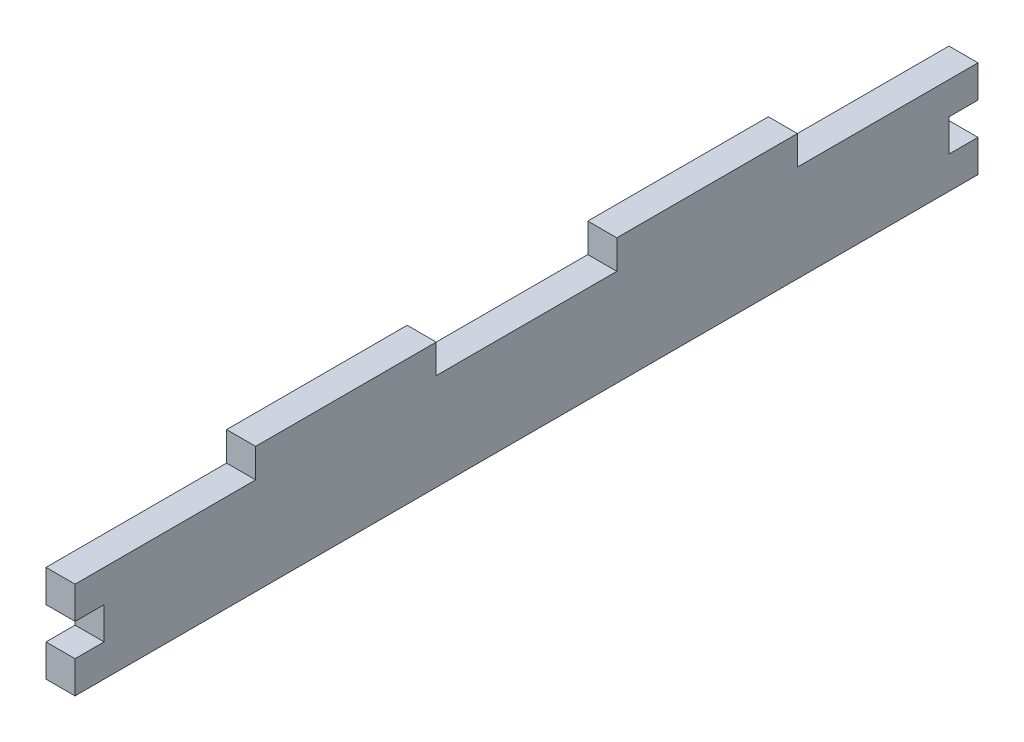
ISO-10303-21;
HEADER;
FILE_DESCRIPTION(('STEP AP214'),'2;1');
FILE_NAME('part.step','',(''),(''),'','','');
FILE_SCHEMA(('AUTOMOTIVE_DESIGN { 1 0 10303 214 1 1 1 1 }'));
ENDSEC;
DATA;
#1=APPLICATION_CONTEXT('core data for automotive mechanical design processes');
#2=APPLICATION_PROTOCOL_DEFINITION('international standard','automotive_design',2000,#1);
#3=PRODUCT_CONTEXT('',#1,'mechanical');
#4=PRODUCT('Part','Part','',(#3));
#5=PRODUCT_RELATED_PRODUCT_CATEGORY('part','',(#4));
#6=PRODUCT_DEFINITION_FORMATION('','',#4);
#7=PRODUCT_DEFINITION_CONTEXT('part definition',#1,'design');
#8=PRODUCT_DEFINITION('design','',#6,#7);
#9=PRODUCT_DEFINITION_SHAPE('','',#8);
#10=(LENGTH_UNIT() NAMED_UNIT(*) SI_UNIT(.MILLI.,.METRE.));
#11=(NAMED_UNIT(*) PLANE_ANGLE_UNIT() SI_UNIT($,.RADIAN.));
#12=(NAMED_UNIT(*) SI_UNIT($,.STERADIAN.) SOLID_ANGLE_UNIT());
#13=UNCERTAINTY_MEASURE_WITH_UNIT(LENGTH_MEASURE(1.E-05),#10,'distance_accuracy_value','');
#14=(GEOMETRIC_REPRESENTATION_CONTEXT(3) GLOBAL_UNCERTAINTY_ASSIGNED_CONTEXT((#13)) GLOBAL_UNIT_ASSIGNED_CONTEXT((#10,
#11,#12)) REPRESENTATION_CONTEXT('',''));
#15=CARTESIAN_POINT('',(0.,0.,0.));
#16=DIRECTION('',(0.,0.,1.));
#17=DIRECTION('',(1.,0.,0.));
#18=AXIS2_PLACEMENT_3D('',#15,#16,#17);
#19=CARTESIAN_POINT('',(2.15683952179781E-13,-14.,-93.2499999999994));
#20=DIRECTION('',(0.,0.,1.));
#21=DIRECTION('',(1.,0.,0.));
#22=AXIS2_PLACEMENT_3D('',#19,#20,#21);
#23=PLANE('',#22);
#24=DIRECTION('',(0.,1.,0.));
#25=VECTOR('',#24,1.);
#26=CARTESIAN_POINT('',(-231.5,-14.,-93.2499999999999));
#27=LINE('',#26,#25);
#28=CARTESIAN_POINT('',(-231.5,-0.666666666666667,-93.25));
#29=VERTEX_POINT('',#28);
#30=CARTESIAN_POINT('',(-231.5,6.,-93.2499999999999));
#31=VERTEX_POINT('',#30);
#32=EDGE_CURVE('E298',#29,#31,#27,.T.);
#33=ORIENTED_EDGE('',*,*,#32,.F.);
#34=DIRECTION('',(1.,0.,0.));
#35=VECTOR('',#34,1.);
#36=CARTESIAN_POINT('',(0.,-0.666666666666633,-93.25));
#37=LINE('',#36,#35);
#38=CARTESIAN_POINT('',(-237.5,-0.666666666666667,-93.25));
#39=VERTEX_POINT('',#38);
#40=EDGE_CURVE('E183',#39,#29,#37,.T.);
#41=ORIENTED_EDGE('',*,*,#40,.F.);
#42=DIRECTION('',(0.,1.,0.));
#43=VECTOR('',#42,1.);
#44=CARTESIAN_POINT('',(-237.5,-14.,-93.2499999999999));
#45=LINE('',#44,#43);
#46=CARTESIAN_POINT('',(-237.5,6.,-93.2499999999999));
#47=VERTEX_POINT('',#46);
#48=EDGE_CURVE('E318',#39,#47,#45,.T.);
#49=ORIENTED_EDGE('',*,*,#48,.T.);
#50=DIRECTION('',(1.,0.,0.));
#51=VECTOR('',#50,1.);
#52=CARTESIAN_POINT('',(2.15683952179781E-13,6.,-93.2499999999994));
#53=LINE('',#52,#51);
#54=EDGE_CURVE('E302',#47,#31,#53,.T.);
#55=ORIENTED_EDGE('',*,*,#54,.T.);
#56=EDGE_LOOP('',(#33,#41,#49,#55));
#57=FACE_BOUND('',#56,.T.);
#58=ADVANCED_FACE('F36',(#57),#23,.F.);
#59=CARTESIAN_POINT('',(-231.5,-14.,1.72263156970995E-13));
#60=DIRECTION('',(-1.,0.,0.));
#61=DIRECTION('',(0.,0.,1.));
#62=AXIS2_PLACEMENT_3D('',#59,#60,#61);
#63=PLANE('',#62);
#64=DIRECTION('',(0.,1.,0.));
#65=VECTOR('',#64,1.);
#66=CARTESIAN_POINT('',(-231.5,0.,-87.25));
#67=LINE('',#66,#65);
#68=CARTESIAN_POINT('',(-231.5,-7.33333333333333,-87.25));
#69=VERTEX_POINT('',#68);
#70=CARTESIAN_POINT('',(-231.5,-0.666666666666667,-87.25));
#71=VERTEX_POINT('',#70);
#72=EDGE_CURVE('E192',#69,#71,#67,.T.);
#73=ORIENTED_EDGE('',*,*,#72,.T.);
#74=DIRECTION('',(0.,0.,-1.));
#75=VECTOR('',#74,1.);
#76=CARTESIAN_POINT('',(-231.5,-0.666666666666667,-87.25));
#77=LINE('',#76,#75);
#78=EDGE_CURVE('E177',#71,#29,#77,.T.);
#79=ORIENTED_EDGE('',*,*,#78,.T.);
#80=ORIENTED_EDGE('',*,*,#32,.T.);
#81=DIRECTION('',(0.,0.,1.));
#82=VECTOR('',#81,1.);
#83=CARTESIAN_POINT('',(-231.5,6.,1.72263156970995E-13));
#84=LINE('',#83,#82);
#85=CARTESIAN_POINT('',(-231.5,6.,-55.9499999999999));
#86=VERTEX_POINT('',#85);
#87=EDGE_CURVE('E299',#31,#86,#84,.T.);
#88=ORIENTED_EDGE('',*,*,#87,.T.);
#89=DIRECTION('',(0.,-1.,0.));
#90=VECTOR('',#89,1.);
#91=CARTESIAN_POINT('',(-231.5,12.,-55.9499999999999));
#92=LINE('',#91,#90);
#93=CARTESIAN_POINT('',(-231.5,12.,-55.9499999999999));
#94=VERTEX_POINT('',#93);
#95=EDGE_CURVE('E274',#94,#86,#92,.T.);
#96=ORIENTED_EDGE('',*,*,#95,.F.);
#97=DIRECTION('',(0.,0.,1.));
#98=VECTOR('',#97,1.);
#99=CARTESIAN_POINT('',(-231.5,12.,0.));
#100=LINE('',#99,#98);
#101=CARTESIAN_POINT('',(-231.5,12.,-18.6499999999999));
#102=VERTEX_POINT('',#101);
#103=EDGE_CURVE('E271',#94,#102,#100,.T.);
#104=ORIENTED_EDGE('',*,*,#103,.T.);
#105=DIRECTION('',(0.,-1.,0.));
#106=VECTOR('',#105,1.);
#107=CARTESIAN_POINT('',(-231.5,12.,-18.6499999999999));
#108=LINE('',#107,#106);
#109=CARTESIAN_POINT('',(-231.5,6.,-18.6499999999999));
#110=VERTEX_POINT('',#109);
#111=EDGE_CURVE('E280',#102,#110,#108,.T.);
#112=ORIENTED_EDGE('',*,*,#111,.T.);
#113=CARTESIAN_POINT('',(-231.5,6.,18.65));
#114=VERTEX_POINT('',#113);
#115=EDGE_CURVE('E303',#110,#114,#84,.T.);
#116=ORIENTED_EDGE('',*,*,#115,.T.);
#117=DIRECTION('',(0.,-1.,0.));
#118=VECTOR('',#117,1.);
#119=CARTESIAN_POINT('',(-231.5,12.,18.65));
#120=LINE('',#119,#118);
#121=CARTESIAN_POINT('',(-231.5,12.,18.65));
#122=VERTEX_POINT('',#121);
#123=EDGE_CURVE('E246',#122,#114,#120,.T.);
#124=ORIENTED_EDGE('',*,*,#123,.F.);
#125=DIRECTION('',(0.,0.,1.));
#126=VECTOR('',#125,1.);
#127=CARTESIAN_POINT('',(-231.5,12.,0.));
#128=LINE('',#127,#126);
#129=CARTESIAN_POINT('',(-231.5,12.,55.95));
#130=VERTEX_POINT('',#129);
#131=EDGE_CURVE('E243',#122,#130,#128,.T.);
#132=ORIENTED_EDGE('',*,*,#131,.T.);
#133=DIRECTION('',(0.,-1.,0.));
#134=VECTOR('',#133,1.);
#135=CARTESIAN_POINT('',(-231.5,12.,55.95));
#136=LINE('',#135,#134);
#137=CARTESIAN_POINT('',(-231.5,6.,55.95));
#138=VERTEX_POINT('',#137);
#139=EDGE_CURVE('E252',#130,#138,#136,.T.);
#140=ORIENTED_EDGE('',*,*,#139,.T.);
#141=CARTESIAN_POINT('',(-231.5,6.,93.25));
#142=VERTEX_POINT('',#141);
#143=EDGE_CURVE('E286',#138,#142,#84,.T.);
#144=ORIENTED_EDGE('',*,*,#143,.T.);
#145=DIRECTION('',(0.,1.,0.));
#146=VECTOR('',#145,1.);
#147=CARTESIAN_POINT('',(-231.5,-14.,93.25));
#148=LINE('',#147,#146);
#149=CARTESIAN_POINT('',(-231.5,-0.666666666666667,93.25));
#150=VERTEX_POINT('',#149);
#151=EDGE_CURVE('E45',#150,#142,#148,.T.);
#152=ORIENTED_EDGE('',*,*,#151,.F.);
#153=DIRECTION('',(0.,0.,1.));
#154=VECTOR('',#153,1.);
#155=CARTESIAN_POINT('',(-231.5,-0.666666666666667,87.25));
#156=LINE('',#155,#154);
#157=CARTESIAN_POINT('',(-231.5,-0.666666666666667,87.25));
#158=VERTEX_POINT('',#157);
#159=EDGE_CURVE('E224',#158,#150,#156,.T.);
#160=ORIENTED_EDGE('',*,*,#159,.F.);
#161=DIRECTION('',(0.,1.,0.));
#162=VECTOR('',#161,1.);
#163=CARTESIAN_POINT('',(-231.5,0.,87.25));
#164=LINE('',#163,#162);
#165=CARTESIAN_POINT('',(-231.5,-7.33333333333333,87.25));
#166=VERTEX_POINT('',#165);
#167=EDGE_CURVE('E217',#166,#158,#164,.T.);
#168=ORIENTED_EDGE('',*,*,#167,.F.);
#169=DIRECTION('',(0.,0.,1.));
#170=VECTOR('',#169,1.);
#171=CARTESIAN_POINT('',(-231.5,-7.33333333333333,87.25));
#172=LINE('',#171,#170);
#173=CARTESIAN_POINT('',(-231.5,-7.33333333333333,93.25));
#174=VERTEX_POINT('',#173);
#175=EDGE_CURVE('E227',#166,#174,#172,.T.);
#176=ORIENTED_EDGE('',*,*,#175,.T.);
#177=CARTESIAN_POINT('',(-231.5,-14.,93.25));
#178=VERTEX_POINT('',#177);
#179=EDGE_CURVE('E11',#178,#174,#148,.T.);
#180=ORIENTED_EDGE('',*,*,#179,.F.);
#181=DIRECTION('',(0.,0.,1.));
#182=VECTOR('',#181,1.);
#183=CARTESIAN_POINT('',(-231.5,-14.,1.72263156970995E-13));
#184=LINE('',#183,#182);
#185=CARTESIAN_POINT('',(-231.5,-14.,-93.2499999999999));
#186=VERTEX_POINT('',#185);
#187=EDGE_CURVE('E287',#186,#178,#184,.T.);
#188=ORIENTED_EDGE('',*,*,#187,.F.);
#189=CARTESIAN_POINT('',(-231.5,-7.33333333333333,-93.2499999999999));
#190=VERTEX_POINT('',#189);
#191=EDGE_CURVE('E40',#186,#190,#27,.T.);
#192=ORIENTED_EDGE('',*,*,#191,.T.);
#193=DIRECTION('',(0.,0.,-1.));
#194=VECTOR('',#193,1.);
#195=CARTESIAN_POINT('',(-231.5,-7.33333333333333,-87.25));
#196=LINE('',#195,#194);
#197=EDGE_CURVE('E53',#69,#190,#196,.T.);
#198=ORIENTED_EDGE('',*,*,#197,.F.);
#199=EDGE_LOOP('',(#73,#79,#80,#88,#96,#104,#112,#116,#124,#132,#140,#144,#152,#160,#168,#176,
#180,#188,#192,#198));
#200=FACE_BOUND('',#199,.T.);
#201=ADVANCED_FACE('F38',(#200),#63,.F.);
#202=CARTESIAN_POINT('',(0.,-14.,93.25));
#203=DIRECTION('',(0.,0.,1.));
#204=DIRECTION('',(1.,0.,0.));
#205=AXIS2_PLACEMENT_3D('',#202,#203,#204);
#206=PLANE('',#205);
#207=DIRECTION('',(0.,1.,0.));
#208=VECTOR('',#207,1.);
#209=CARTESIAN_POINT('',(-237.5,-14.,93.25));
#210=LINE('',#209,#208);
#211=CARTESIAN_POINT('',(-237.5,-0.666666666666667,93.25));
#212=VERTEX_POINT('',#211);
#213=CARTESIAN_POINT('',(-237.5,6.,93.25));
#214=VERTEX_POINT('',#213);
#215=EDGE_CURVE('E315',#212,#214,#210,.T.);
#216=ORIENTED_EDGE('',*,*,#215,.F.);
#217=DIRECTION('',(1.,0.,0.));
#218=VECTOR('',#217,1.);
#219=CARTESIAN_POINT('',(0.,-0.666666666666633,93.25));
#220=LINE('',#219,#218);
#221=EDGE_CURVE('E206',#212,#150,#220,.T.);
#222=ORIENTED_EDGE('',*,*,#221,.T.);
#223=ORIENTED_EDGE('',*,*,#151,.T.);
#224=DIRECTION('',(1.,0.,0.));
#225=VECTOR('',#224,1.);
#226=CARTESIAN_POINT('',(0.,6.,93.25));
#227=LINE('',#226,#225);
#228=EDGE_CURVE('E290',#214,#142,#227,.T.);
#229=ORIENTED_EDGE('',*,*,#228,.F.);
#230=EDGE_LOOP('',(#216,#222,#223,#229));
#231=FACE_BOUND('',#230,.T.);
#232=ADVANCED_FACE('F359',(#231),#206,.T.);
#233=ORIENTED_EDGE('',*,*,#179,.T.);
#234=DIRECTION('',(-1.,0.,0.));
#235=VECTOR('',#234,1.);
#236=CARTESIAN_POINT('',(0.,-7.33333333333333,93.25));
#237=LINE('',#236,#235);
#238=CARTESIAN_POINT('',(-237.5,-7.33333333333333,93.25));
#239=VERTEX_POINT('',#238);
#240=EDGE_CURVE('E213',#174,#239,#237,.T.);
#241=ORIENTED_EDGE('',*,*,#240,.T.);
#242=CARTESIAN_POINT('',(-237.5,-14.,93.25));
#243=VERTEX_POINT('',#242);
#244=EDGE_CURVE('E313',#243,#239,#210,.T.);
#245=ORIENTED_EDGE('',*,*,#244,.F.);
#246=DIRECTION('',(1.,0.,0.));
#247=VECTOR('',#246,1.);
#248=CARTESIAN_POINT('',(0.,-14.,93.25));
#249=LINE('',#248,#247);
#250=EDGE_CURVE('E295',#243,#178,#249,.T.);
#251=ORIENTED_EDGE('',*,*,#250,.T.);
#252=EDGE_LOOP('',(#233,#241,#245,#251));
#253=FACE_BOUND('',#252,.T.);
#254=ADVANCED_FACE('F372',(#253),#206,.T.);
#255=CARTESIAN_POINT('',(-237.5,-14.,0.));
#256=DIRECTION('',(-1.,0.,0.));
#257=DIRECTION('',(0.,0.,1.));
#258=AXIS2_PLACEMENT_3D('',#255,#256,#257);
#259=PLANE('',#258);
#260=DIRECTION('',(0.,0.,-1.));
#261=VECTOR('',#260,1.);
#262=CARTESIAN_POINT('',(-237.5,-0.666666666666667,-87.25));
#263=LINE('',#262,#261);
#264=CARTESIAN_POINT('',(-237.5,-0.666666666666667,-87.25));
#265=VERTEX_POINT('',#264);
#266=EDGE_CURVE('E204',#265,#39,#263,.T.);
#267=ORIENTED_EDGE('',*,*,#266,.F.);
#268=DIRECTION('',(0.,-1.,0.));
#269=VECTOR('',#268,1.);
#270=CARTESIAN_POINT('',(-237.5,0.,-87.25));
#271=LINE('',#270,#269);
#272=CARTESIAN_POINT('',(-237.5,-7.33333333333333,-87.25));
#273=VERTEX_POINT('',#272);
#274=EDGE_CURVE('E187',#265,#273,#271,.T.);
#275=ORIENTED_EDGE('',*,*,#274,.T.);
#276=DIRECTION('',(0.,0.,-1.));
#277=VECTOR('',#276,1.);
#278=CARTESIAN_POINT('',(-237.5,-7.33333333333333,-87.25));
#279=LINE('',#278,#277);
#280=CARTESIAN_POINT('',(-237.5,-7.33333333333333,-93.25));
#281=VERTEX_POINT('',#280);
#282=EDGE_CURVE('E207',#273,#281,#279,.T.);
#283=ORIENTED_EDGE('',*,*,#282,.T.);
#284=CARTESIAN_POINT('',(-237.5,-14.,-93.2499999999999));
#285=VERTEX_POINT('',#284);
#286=EDGE_CURVE('E316',#285,#281,#45,.T.);
#287=ORIENTED_EDGE('',*,*,#286,.F.);
#288=DIRECTION('',(0.,0.,1.));
#289=VECTOR('',#288,1.);
#290=CARTESIAN_POINT('',(-237.5,-14.,0.));
#291=LINE('',#290,#289);
#292=EDGE_CURVE('E292',#285,#243,#291,.T.);
#293=ORIENTED_EDGE('',*,*,#292,.T.);
#294=ORIENTED_EDGE('',*,*,#244,.T.);
#295=DIRECTION('',(0.,0.,1.));
#296=VECTOR('',#295,1.);
#297=CARTESIAN_POINT('',(-237.5,-7.33333333333333,87.25));
#298=LINE('',#297,#296);
#299=CARTESIAN_POINT('',(-237.5,-7.33333333333333,87.25));
#300=VERTEX_POINT('',#299);
#301=EDGE_CURVE('E230',#300,#239,#298,.T.);
#302=ORIENTED_EDGE('',*,*,#301,.F.);
#303=DIRECTION('',(0.,-1.,0.));
#304=VECTOR('',#303,1.);
#305=CARTESIAN_POINT('',(-237.5,0.,87.25));
#306=LINE('',#305,#304);
#307=CARTESIAN_POINT('',(-237.5,-0.666666666666666,87.25));
#308=VERTEX_POINT('',#307);
#309=EDGE_CURVE('E212',#308,#300,#306,.T.);
#310=ORIENTED_EDGE('',*,*,#309,.F.);
#311=DIRECTION('',(0.,0.,1.));
#312=VECTOR('',#311,1.);
#313=CARTESIAN_POINT('',(-237.5,-0.666666666666667,87.25));
#314=LINE('',#313,#312);
#315=EDGE_CURVE('E219',#308,#212,#314,.T.);
#316=ORIENTED_EDGE('',*,*,#315,.T.);
#317=ORIENTED_EDGE('',*,*,#215,.T.);
#318=DIRECTION('',(0.,0.,1.));
#319=VECTOR('',#318,1.);
#320=CARTESIAN_POINT('',(-237.5,6.,0.));
#321=LINE('',#320,#319);
#322=CARTESIAN_POINT('',(-237.5,6.,55.95));
#323=VERTEX_POINT('',#322);
#324=EDGE_CURVE('E306',#323,#214,#321,.T.);
#325=ORIENTED_EDGE('',*,*,#324,.F.);
#326=DIRECTION('',(0.,-1.,0.));
#327=VECTOR('',#326,1.);
#328=CARTESIAN_POINT('',(-237.5,12.,55.95));
#329=LINE('',#328,#327);
#330=CARTESIAN_POINT('',(-237.5,12.,55.95));
#331=VERTEX_POINT('',#330);
#332=EDGE_CURVE('E255',#331,#323,#329,.T.);
#333=ORIENTED_EDGE('',*,*,#332,.F.);
#334=DIRECTION('',(0.,0.,1.));
#335=VECTOR('',#334,1.);
#336=CARTESIAN_POINT('',(-237.5,12.,0.));
#337=LINE('',#336,#335);
#338=CARTESIAN_POINT('',(-237.5,12.,18.65));
#339=VERTEX_POINT('',#338);
#340=EDGE_CURVE('E237',#339,#331,#337,.T.);
#341=ORIENTED_EDGE('',*,*,#340,.F.);
#342=DIRECTION('',(0.,-1.,0.));
#343=VECTOR('',#342,1.);
#344=CARTESIAN_POINT('',(-237.5,12.,18.65));
#345=LINE('',#344,#343);
#346=CARTESIAN_POINT('',(-237.5,6.,18.65));
#347=VERTEX_POINT('',#346);
#348=EDGE_CURVE('E258',#339,#347,#345,.T.);
#349=ORIENTED_EDGE('',*,*,#348,.T.);
#350=CARTESIAN_POINT('',(-237.5,6.,-18.6499999999999));
#351=VERTEX_POINT('',#350);
#352=EDGE_CURVE('E310',#351,#347,#321,.T.);
#353=ORIENTED_EDGE('',*,*,#352,.F.);
#354=DIRECTION('',(0.,-1.,0.));
#355=VECTOR('',#354,1.);
#356=CARTESIAN_POINT('',(-237.5,12.,-18.6499999999999));
#357=LINE('',#356,#355);
#358=CARTESIAN_POINT('',(-237.5,12.,-18.6499999999999));
#359=VERTEX_POINT('',#358);
#360=EDGE_CURVE('E282',#359,#351,#357,.T.);
#361=ORIENTED_EDGE('',*,*,#360,.F.);
#362=DIRECTION('',(0.,0.,1.));
#363=VECTOR('',#362,1.);
#364=CARTESIAN_POINT('',(-237.5,12.,0.));
#365=LINE('',#364,#363);
#366=CARTESIAN_POINT('',(-237.5,12.,-55.9499999999999));
#367=VERTEX_POINT('',#366);
#368=EDGE_CURVE('E265',#367,#359,#365,.T.);
#369=ORIENTED_EDGE('',*,*,#368,.F.);
#370=DIRECTION('',(0.,-1.,0.));
#371=VECTOR('',#370,1.);
#372=CARTESIAN_POINT('',(-237.5,12.,-55.9499999999999));
#373=LINE('',#372,#371);
#374=CARTESIAN_POINT('',(-237.5,6.,-55.9499999999999));
#375=VERTEX_POINT('',#374);
#376=EDGE_CURVE('E284',#367,#375,#373,.T.);
#377=ORIENTED_EDGE('',*,*,#376,.T.);
#378=EDGE_CURVE('E307',#47,#375,#321,.T.);
#379=ORIENTED_EDGE('',*,*,#378,.F.);
#380=ORIENTED_EDGE('',*,*,#48,.F.);
#381=EDGE_LOOP('',(#267,#275,#283,#287,#293,#294,#302,#310,#316,#317,#325,#333,#341,#349,#353,
#361,#369,#377,#379,#380));
#382=FACE_BOUND('',#381,.T.);
#383=ADVANCED_FACE('F364',(#382),#259,.T.);
#384=CARTESIAN_POINT('',(0.,6.,0.));
#385=DIRECTION('',(0.,1.,0.));
#386=DIRECTION('',(0.,0.,1.));
#387=AXIS2_PLACEMENT_3D('',#384,#385,#386);
#388=PLANE('',#387);
#389=DIRECTION('',(1.,0.,0.));
#390=VECTOR('',#389,1.);
#391=CARTESIAN_POINT('',(0.,6.,18.65));
#392=LINE('',#391,#390);
#393=EDGE_CURVE('E226',#347,#114,#392,.T.);
#394=ORIENTED_EDGE('',*,*,#393,.T.);
#395=ORIENTED_EDGE('',*,*,#115,.F.);
#396=DIRECTION('',(-1.,0.,0.));
#397=VECTOR('',#396,1.);
#398=CARTESIAN_POINT('',(0.,6.,-18.6499999999999));
#399=LINE('',#398,#397);
#400=EDGE_CURVE('E266',#110,#351,#399,.T.);
#401=ORIENTED_EDGE('',*,*,#400,.T.);
#402=ORIENTED_EDGE('',*,*,#352,.T.);
#403=EDGE_LOOP('',(#394,#395,#401,#402));
#404=FACE_BOUND('',#403,.T.);
#405=ADVANCED_FACE('F347',(#404),#388,.T.);
#406=ORIENTED_EDGE('',*,*,#378,.T.);
#407=DIRECTION('',(1.,0.,0.));
#408=VECTOR('',#407,1.);
#409=CARTESIAN_POINT('',(0.,6.,-55.9499999999999));
#410=LINE('',#409,#408);
#411=EDGE_CURVE('E261',#375,#86,#410,.T.);
#412=ORIENTED_EDGE('',*,*,#411,.T.);
#413=ORIENTED_EDGE('',*,*,#87,.F.);
#414=ORIENTED_EDGE('',*,*,#54,.F.);
#415=EDGE_LOOP('',(#406,#412,#413,#414));
#416=FACE_BOUND('',#415,.T.);
#417=ADVANCED_FACE('F329',(#416),#388,.T.);
#418=DIRECTION('',(-1.,0.,0.));
#419=VECTOR('',#418,1.);
#420=CARTESIAN_POINT('',(0.,6.,55.95));
#421=LINE('',#420,#419);
#422=EDGE_CURVE('E238',#138,#323,#421,.T.);
#423=ORIENTED_EDGE('',*,*,#422,.T.);
#424=ORIENTED_EDGE('',*,*,#324,.T.);
#425=ORIENTED_EDGE('',*,*,#228,.T.);
#426=ORIENTED_EDGE('',*,*,#143,.F.);
#427=EDGE_LOOP('',(#423,#424,#425,#426));
#428=FACE_BOUND('',#427,.T.);
#429=ADVANCED_FACE('F356',(#428),#388,.T.);
#430=ORIENTED_EDGE('',*,*,#286,.T.);
#431=DIRECTION('',(-1.,0.,0.));
#432=VECTOR('',#431,1.);
#433=CARTESIAN_POINT('',(0.,-7.33333333333333,-93.25));
#434=LINE('',#433,#432);
#435=EDGE_CURVE('E194',#190,#281,#434,.T.);
#436=ORIENTED_EDGE('',*,*,#435,.F.);
#437=ORIENTED_EDGE('',*,*,#191,.F.);
#438=DIRECTION('',(1.,0.,0.));
#439=VECTOR('',#438,1.);
#440=CARTESIAN_POINT('',(2.15683952179781E-13,-14.,-93.2499999999994));
#441=LINE('',#440,#439);
#442=EDGE_CURVE('E289',#285,#186,#441,.T.);
#443=ORIENTED_EDGE('',*,*,#442,.F.);
#444=EDGE_LOOP('',(#430,#436,#437,#443));
#445=FACE_BOUND('',#444,.T.);
#446=ADVANCED_FACE('F377',(#445),#23,.F.);
#447=CARTESIAN_POINT('',(0.,-14.,0.));
#448=DIRECTION('',(0.,1.,0.));
#449=DIRECTION('',(0.,0.,1.));
#450=AXIS2_PLACEMENT_3D('',#447,#448,#449);
#451=PLANE('',#450);
#452=ORIENTED_EDGE('',*,*,#187,.T.);
#453=ORIENTED_EDGE('',*,*,#250,.F.);
#454=ORIENTED_EDGE('',*,*,#292,.F.);
#455=ORIENTED_EDGE('',*,*,#442,.T.);
#456=EDGE_LOOP('',(#452,#453,#454,#455));
#457=FACE_BOUND('',#456,.T.);
#458=ADVANCED_FACE('F376',(#457),#451,.F.);
#459=CARTESIAN_POINT('',(0.,12.,-55.9499999999999));
#460=DIRECTION('',(0.,0.,-1.));
#461=DIRECTION('',(-1.,0.,0.));
#462=AXIS2_PLACEMENT_3D('',#459,#460,#461);
#463=PLANE('',#462);
#464=ORIENTED_EDGE('',*,*,#411,.F.);
#465=ORIENTED_EDGE('',*,*,#376,.F.);
#466=DIRECTION('',(1.,0.,0.));
#467=VECTOR('',#466,1.);
#468=CARTESIAN_POINT('',(0.,12.,-55.9499999999999));
#469=LINE('',#468,#467);
#470=EDGE_CURVE('E262',#367,#94,#469,.T.);
#471=ORIENTED_EDGE('',*,*,#470,.T.);
#472=ORIENTED_EDGE('',*,*,#95,.T.);
#473=EDGE_LOOP('',(#464,#465,#471,#472));
#474=FACE_BOUND('',#473,.T.);
#475=ADVANCED_FACE('F332',(#474),#463,.T.);
#476=CARTESIAN_POINT('',(0.,12.,-18.6499999999999));
#477=DIRECTION('',(0.,0.,1.));
#478=DIRECTION('',(1.,0.,0.));
#479=AXIS2_PLACEMENT_3D('',#476,#477,#478);
#480=PLANE('',#479);
#481=ORIENTED_EDGE('',*,*,#400,.F.);
#482=ORIENTED_EDGE('',*,*,#111,.F.);
#483=DIRECTION('',(-1.,0.,0.));
#484=VECTOR('',#483,1.);
#485=CARTESIAN_POINT('',(0.,12.,-18.6499999999999));
#486=LINE('',#485,#484);
#487=EDGE_CURVE('E268',#102,#359,#486,.T.);
#488=ORIENTED_EDGE('',*,*,#487,.T.);
#489=ORIENTED_EDGE('',*,*,#360,.T.);
#490=EDGE_LOOP('',(#481,#482,#488,#489));
#491=FACE_BOUND('',#490,.T.);
#492=ADVANCED_FACE('F343',(#491),#480,.T.);
#493=CARTESIAN_POINT('',(0.,12.,0.));
#494=DIRECTION('',(0.,1.,0.));
#495=DIRECTION('',(0.,0.,1.));
#496=AXIS2_PLACEMENT_3D('',#493,#494,#495);
#497=PLANE('',#496);
#498=ORIENTED_EDGE('',*,*,#470,.F.);
#499=ORIENTED_EDGE('',*,*,#368,.T.);
#500=ORIENTED_EDGE('',*,*,#487,.F.);
#501=ORIENTED_EDGE('',*,*,#103,.F.);
#502=EDGE_LOOP('',(#498,#499,#500,#501));
#503=FACE_BOUND('',#502,.T.);
#504=ADVANCED_FACE('F340',(#503),#497,.T.);
#505=CARTESIAN_POINT('',(0.,12.,18.65));
#506=DIRECTION('',(0.,0.,-1.));
#507=DIRECTION('',(-1.,0.,0.));
#508=AXIS2_PLACEMENT_3D('',#505,#506,#507);
#509=PLANE('',#508);
#510=ORIENTED_EDGE('',*,*,#393,.F.);
#511=ORIENTED_EDGE('',*,*,#348,.F.);
#512=DIRECTION('',(1.,0.,0.));
#513=VECTOR('',#512,1.);
#514=CARTESIAN_POINT('',(0.,12.,18.65));
#515=LINE('',#514,#513);
#516=EDGE_CURVE('E234',#339,#122,#515,.T.);
#517=ORIENTED_EDGE('',*,*,#516,.T.);
#518=ORIENTED_EDGE('',*,*,#123,.T.);
#519=EDGE_LOOP('',(#510,#511,#517,#518));
#520=FACE_BOUND('',#519,.T.);
#521=ADVANCED_FACE('F383',(#520),#509,.T.);
#522=CARTESIAN_POINT('',(0.,12.,55.95));
#523=DIRECTION('',(0.,0.,1.));
#524=DIRECTION('',(1.,0.,0.));
#525=AXIS2_PLACEMENT_3D('',#522,#523,#524);
#526=PLANE('',#525);
#527=ORIENTED_EDGE('',*,*,#422,.F.);
#528=ORIENTED_EDGE('',*,*,#139,.F.);
#529=DIRECTION('',(-1.,0.,0.));
#530=VECTOR('',#529,1.);
#531=CARTESIAN_POINT('',(0.,12.,55.95));
#532=LINE('',#531,#530);
#533=EDGE_CURVE('E240',#130,#331,#532,.T.);
#534=ORIENTED_EDGE('',*,*,#533,.T.);
#535=ORIENTED_EDGE('',*,*,#332,.T.);
#536=EDGE_LOOP('',(#527,#528,#534,#535));
#537=FACE_BOUND('',#536,.T.);
#538=ADVANCED_FACE('F389',(#537),#526,.T.);
#539=CARTESIAN_POINT('',(0.,12.,0.));
#540=DIRECTION('',(0.,1.,0.));
#541=DIRECTION('',(0.,0.,1.));
#542=AXIS2_PLACEMENT_3D('',#539,#540,#541);
#543=PLANE('',#542);
#544=ORIENTED_EDGE('',*,*,#516,.F.);
#545=ORIENTED_EDGE('',*,*,#340,.T.);
#546=ORIENTED_EDGE('',*,*,#533,.F.);
#547=ORIENTED_EDGE('',*,*,#131,.F.);
#548=EDGE_LOOP('',(#544,#545,#546,#547));
#549=FACE_BOUND('',#548,.T.);
#550=ADVANCED_FACE('F387',(#549),#543,.T.);
#551=CARTESIAN_POINT('',(0.,-0.666666666666633,87.25));
#552=DIRECTION('',(0.,-1.,0.));
#553=DIRECTION('',(1.,0.,0.));
#554=AXIS2_PLACEMENT_3D('',#551,#552,#553);
#555=PLANE('',#554);
#556=ORIENTED_EDGE('',*,*,#221,.F.);
#557=ORIENTED_EDGE('',*,*,#315,.F.);
#558=DIRECTION('',(1.,0.,0.));
#559=VECTOR('',#558,1.);
#560=CARTESIAN_POINT('',(0.,-0.666666666666633,87.25));
#561=LINE('',#560,#559);
#562=EDGE_CURVE('E61',#308,#158,#561,.T.);
#563=ORIENTED_EDGE('',*,*,#562,.T.);
#564=ORIENTED_EDGE('',*,*,#159,.T.);
#565=EDGE_LOOP('',(#556,#557,#563,#564));
#566=FACE_BOUND('',#565,.T.);
#567=ADVANCED_FACE('F361',(#566),#555,.T.);
#568=CARTESIAN_POINT('',(0.,-7.33333333333333,87.25));
#569=DIRECTION('',(0.,1.,0.));
#570=DIRECTION('',(0.,0.,1.));
#571=AXIS2_PLACEMENT_3D('',#568,#569,#570);
#572=PLANE('',#571);
#573=ORIENTED_EDGE('',*,*,#240,.F.);
#574=ORIENTED_EDGE('',*,*,#175,.F.);
#575=DIRECTION('',(-1.,0.,0.));
#576=VECTOR('',#575,1.);
#577=CARTESIAN_POINT('',(0.,-7.33333333333333,87.25));
#578=LINE('',#577,#576);
#579=EDGE_CURVE('E215',#166,#300,#578,.T.);
#580=ORIENTED_EDGE('',*,*,#579,.T.);
#581=ORIENTED_EDGE('',*,*,#301,.T.);
#582=EDGE_LOOP('',(#573,#574,#580,#581));
#583=FACE_BOUND('',#582,.T.);
#584=ADVANCED_FACE('F442',(#583),#572,.T.);
#585=CARTESIAN_POINT('',(0.,0.,87.25));
#586=DIRECTION('',(0.,0.,1.));
#587=DIRECTION('',(1.,0.,0.));
#588=AXIS2_PLACEMENT_3D('',#585,#586,#587);
#589=PLANE('',#588);
#590=ORIENTED_EDGE('',*,*,#562,.F.);
#591=ORIENTED_EDGE('',*,*,#309,.T.);
#592=ORIENTED_EDGE('',*,*,#579,.F.);
#593=ORIENTED_EDGE('',*,*,#167,.T.);
#594=EDGE_LOOP('',(#590,#591,#592,#593));
#595=FACE_BOUND('',#594,.T.);
#596=ADVANCED_FACE('F367',(#595),#589,.T.);
#597=CARTESIAN_POINT('',(0.,-0.666666666666633,-87.25));
#598=DIRECTION('',(0.,1.,0.));
#599=DIRECTION('',(-1.,0.,0.));
#600=AXIS2_PLACEMENT_3D('',#597,#598,#599);
#601=PLANE('',#600);
#602=ORIENTED_EDGE('',*,*,#40,.T.);
#603=ORIENTED_EDGE('',*,*,#78,.F.);
#604=DIRECTION('',(1.,0.,0.));
#605=VECTOR('',#604,1.);
#606=CARTESIAN_POINT('',(0.,-0.666666666666633,-87.25));
#607=LINE('',#606,#605);
#608=EDGE_CURVE('E180',#265,#71,#607,.T.);
#609=ORIENTED_EDGE('',*,*,#608,.F.);
#610=ORIENTED_EDGE('',*,*,#266,.T.);
#611=EDGE_LOOP('',(#602,#603,#609,#610));
#612=FACE_BOUND('',#611,.T.);
#613=ADVANCED_FACE('F179',(#612),#601,.F.);
#614=CARTESIAN_POINT('',(0.,-7.33333333333333,-87.25));
#615=DIRECTION('',(0.,-1.,0.));
#616=DIRECTION('',(0.,0.,-1.));
#617=AXIS2_PLACEMENT_3D('',#614,#615,#616);
#618=PLANE('',#617);
#619=ORIENTED_EDGE('',*,*,#435,.T.);
#620=ORIENTED_EDGE('',*,*,#282,.F.);
#621=DIRECTION('',(-1.,0.,0.));
#622=VECTOR('',#621,1.);
#623=CARTESIAN_POINT('',(0.,-7.33333333333333,-87.25));
#624=LINE('',#623,#622);
#625=EDGE_CURVE('E197',#69,#273,#624,.T.);
#626=ORIENTED_EDGE('',*,*,#625,.F.);
#627=ORIENTED_EDGE('',*,*,#197,.T.);
#628=EDGE_LOOP('',(#619,#620,#626,#627));
#629=FACE_BOUND('',#628,.T.);
#630=ADVANCED_FACE('F378',(#629),#618,.F.);
#631=CARTESIAN_POINT('',(0.,0.,-87.25));
#632=DIRECTION('',(0.,0.,-1.));
#633=DIRECTION('',(1.,0.,0.));
#634=AXIS2_PLACEMENT_3D('',#631,#632,#633);
#635=PLANE('',#634);
#636=ORIENTED_EDGE('',*,*,#608,.T.);
#637=ORIENTED_EDGE('',*,*,#72,.F.);
#638=ORIENTED_EDGE('',*,*,#625,.T.);
#639=ORIENTED_EDGE('',*,*,#274,.F.);
#640=EDGE_LOOP('',(#636,#637,#638,#639));
#641=FACE_BOUND('',#640,.T.);
#642=ADVANCED_FACE('F190',(#641),#635,.T.);
#643=CLOSED_SHELL('',(#58,#201,#232,#254,#383,#405,#417,#429,#446,#458,#475,#492,#504,#521,#538,
#550,#567,#584,#596,#613,#630,#642));
#644=MANIFOLD_SOLID_BREP('B2',#643);
#645=ADVANCED_BREP_SHAPE_REPRESENTATION('',(#18,#644),#14);
#646=SHAPE_DEFINITION_REPRESENTATION(#9,#645);
ENDSEC;
END-ISO-10303-21;
